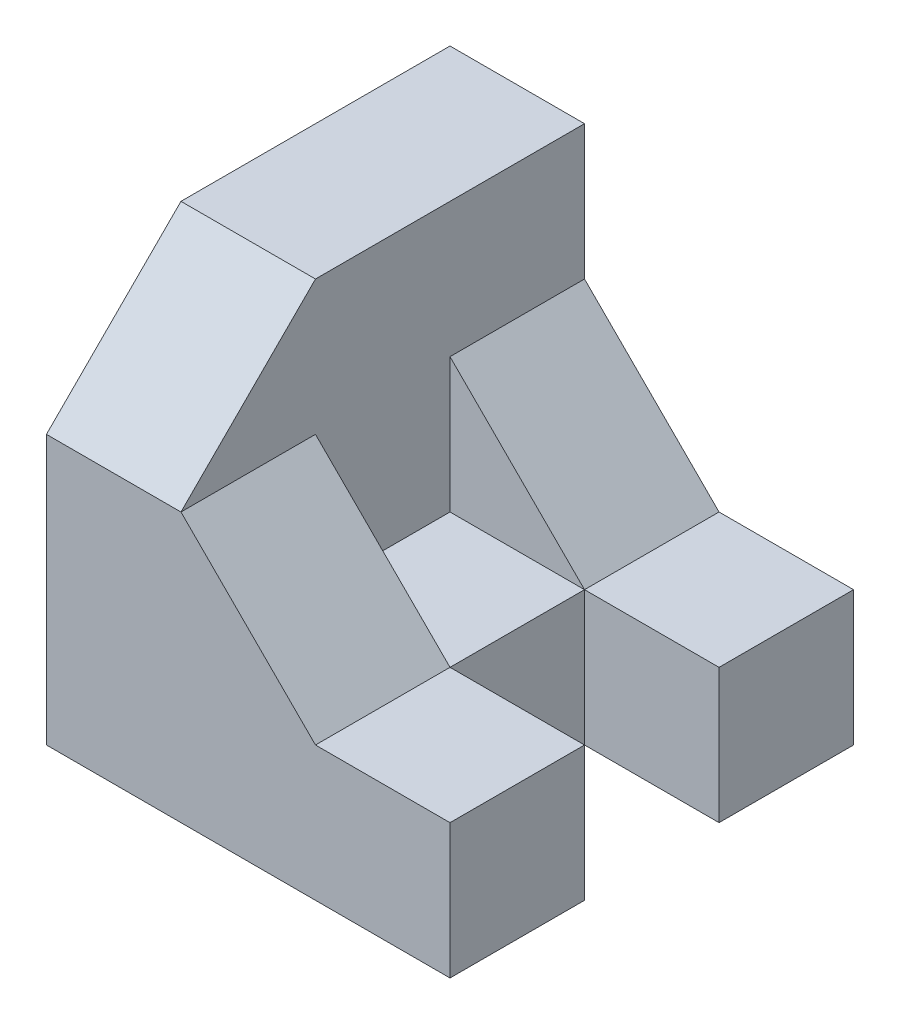
ISO-10303-21;
HEADER;
FILE_DESCRIPTION(('STEP AP214'),'2;1');
FILE_NAME('part.step','',(''),(''),'','','');
FILE_SCHEMA(('AUTOMOTIVE_DESIGN { 1 0 10303 214 1 1 1 1 }'));
ENDSEC;
DATA;
#1=APPLICATION_CONTEXT('core data for automotive mechanical design processes');
#2=APPLICATION_PROTOCOL_DEFINITION('international standard','automotive_design',2000,#1);
#3=PRODUCT_CONTEXT('',#1,'mechanical');
#4=PRODUCT('Part','Part','',(#3));
#5=PRODUCT_RELATED_PRODUCT_CATEGORY('part','',(#4));
#6=PRODUCT_DEFINITION_FORMATION('','',#4);
#7=PRODUCT_DEFINITION_CONTEXT('part definition',#1,'design');
#8=PRODUCT_DEFINITION('design','',#6,#7);
#9=PRODUCT_DEFINITION_SHAPE('','',#8);
#10=(LENGTH_UNIT() NAMED_UNIT(*) SI_UNIT(.MILLI.,.METRE.));
#11=(NAMED_UNIT(*) PLANE_ANGLE_UNIT() SI_UNIT($,.RADIAN.));
#12=(NAMED_UNIT(*) SI_UNIT($,.STERADIAN.) SOLID_ANGLE_UNIT());
#13=UNCERTAINTY_MEASURE_WITH_UNIT(LENGTH_MEASURE(1.E-05),#10,'distance_accuracy_value','');
#14=(GEOMETRIC_REPRESENTATION_CONTEXT(3) GLOBAL_UNCERTAINTY_ASSIGNED_CONTEXT((#13)) GLOBAL_UNIT_ASSIGNED_CONTEXT((#10,
#11,#12)) REPRESENTATION_CONTEXT('',''));
#15=CARTESIAN_POINT('',(0.,0.,0.));
#16=DIRECTION('',(0.,0.,1.));
#17=DIRECTION('',(1.,0.,0.));
#18=AXIS2_PLACEMENT_3D('',#15,#16,#17);
#19=CARTESIAN_POINT('',(60.,60.,0.));
#20=DIRECTION('',(-1.,0.,0.));
#21=DIRECTION('',(0.,0.,1.));
#22=AXIS2_PLACEMENT_3D('',#19,#20,#21);
#23=PLANE('',#22);
#24=DIRECTION('',(0.,0.,-1.));
#25=VECTOR('',#24,1.);
#26=CARTESIAN_POINT('',(60.,20.,0.));
#27=LINE('',#26,#25);
#28=CARTESIAN_POINT('',(60.,20.,20.));
#29=VERTEX_POINT('',#28);
#30=CARTESIAN_POINT('',(60.,20.,0.));
#31=VERTEX_POINT('',#30);
#32=EDGE_CURVE('E174',#29,#31,#27,.T.);
#33=ORIENTED_EDGE('',*,*,#32,.F.);
#34=DIRECTION('',(0.,1.,0.));
#35=VECTOR('',#34,1.);
#36=CARTESIAN_POINT('',(60.,-40.,20.));
#37=LINE('',#36,#35);
#38=CARTESIAN_POINT('',(60.,0.,20.));
#39=VERTEX_POINT('',#38);
#40=EDGE_CURVE('E89',#39,#29,#37,.T.);
#41=ORIENTED_EDGE('',*,*,#40,.F.);
#42=DIRECTION('',(0.,0.,-1.));
#43=VECTOR('',#42,1.);
#44=CARTESIAN_POINT('',(60.,0.,0.));
#45=LINE('',#44,#43);
#46=CARTESIAN_POINT('',(60.,0.,0.));
#47=VERTEX_POINT('',#46);
#48=EDGE_CURVE('E82',#39,#47,#45,.T.);
#49=ORIENTED_EDGE('',*,*,#48,.T.);
#50=DIRECTION('',(0.,-1.,0.));
#51=VECTOR('',#50,1.);
#52=CARTESIAN_POINT('',(60.,60.,0.));
#53=LINE('',#52,#51);
#54=EDGE_CURVE('E86',#31,#47,#53,.T.);
#55=ORIENTED_EDGE('',*,*,#54,.F.);
#56=EDGE_LOOP('',(#33,#41,#49,#55));
#57=FACE_BOUND('',#56,.T.);
#58=ADVANCED_FACE('F39',(#57),#23,.F.);
#59=CARTESIAN_POINT('',(0.,20.,0.));
#60=DIRECTION('',(0.,-1.,0.));
#61=DIRECTION('',(0.,0.,-1.));
#62=AXIS2_PLACEMENT_3D('',#59,#60,#61);
#63=PLANE('',#62);
#64=DIRECTION('',(0.,0.,1.));
#65=VECTOR('',#64,1.);
#66=CARTESIAN_POINT('',(40.,20.,0.));
#67=LINE('',#66,#65);
#68=CARTESIAN_POINT('',(40.,20.,0.));
#69=VERTEX_POINT('',#68);
#70=CARTESIAN_POINT('',(40.,20.,20.));
#71=VERTEX_POINT('',#70);
#72=EDGE_CURVE('E163',#69,#71,#67,.T.);
#73=ORIENTED_EDGE('',*,*,#72,.T.);
#74=DIRECTION('',(-1.,0.,0.));
#75=VECTOR('',#74,1.);
#76=CARTESIAN_POINT('',(60.,20.,20.));
#77=LINE('',#76,#75);
#78=EDGE_CURVE('E251',#29,#71,#77,.T.);
#79=ORIENTED_EDGE('',*,*,#78,.F.);
#80=ORIENTED_EDGE('',*,*,#32,.T.);
#81=DIRECTION('',(-1.,0.,0.));
#82=VECTOR('',#81,1.);
#83=CARTESIAN_POINT('',(60.,20.,0.));
#84=LINE('',#83,#82);
#85=EDGE_CURVE('E104',#31,#69,#84,.T.);
#86=ORIENTED_EDGE('',*,*,#85,.T.);
#87=EDGE_LOOP('',(#73,#79,#80,#86));
#88=FACE_BOUND('',#87,.T.);
#89=ADVANCED_FACE('F289',(#88),#63,.F.);
#90=CARTESIAN_POINT('',(60.,20.,60.));
#91=VERTEX_POINT('',#90);
#92=CARTESIAN_POINT('',(60.,20.,40.));
#93=VERTEX_POINT('',#92);
#94=EDGE_CURVE('E170',#91,#93,#27,.T.);
#95=ORIENTED_EDGE('',*,*,#94,.T.);
#96=DIRECTION('',(1.,0.,0.));
#97=VECTOR('',#96,1.);
#98=CARTESIAN_POINT('',(40.,20.,40.));
#99=LINE('',#98,#97);
#100=CARTESIAN_POINT('',(40.,20.,40.));
#101=VERTEX_POINT('',#100);
#102=EDGE_CURVE('E234',#101,#93,#99,.T.);
#103=ORIENTED_EDGE('',*,*,#102,.F.);
#104=CARTESIAN_POINT('',(40.,20.,60.));
#105=VERTEX_POINT('',#104);
#106=EDGE_CURVE('E167',#101,#105,#67,.T.);
#107=ORIENTED_EDGE('',*,*,#106,.T.);
#108=DIRECTION('',(1.,0.,0.));
#109=VECTOR('',#108,1.);
#110=CARTESIAN_POINT('',(60.,20.,60.));
#111=LINE('',#110,#109);
#112=EDGE_CURVE('E156',#105,#91,#111,.T.);
#113=ORIENTED_EDGE('',*,*,#112,.T.);
#114=EDGE_LOOP('',(#95,#103,#107,#113));
#115=FACE_BOUND('',#114,.T.);
#116=ADVANCED_FACE('F316',(#115),#63,.F.);
#117=CARTESIAN_POINT('',(0.,60.,0.));
#118=DIRECTION('',(1.,0.,0.));
#119=DIRECTION('',(0.,0.,-1.));
#120=AXIS2_PLACEMENT_3D('',#117,#118,#119);
#121=PLANE('',#120);
#122=DIRECTION('',(0.,-1.,0.));
#123=VECTOR('',#122,1.);
#124=CARTESIAN_POINT('',(0.,60.,60.));
#125=LINE('',#124,#123);
#126=CARTESIAN_POINT('',(0.,40.,60.));
#127=VERTEX_POINT('',#126);
#128=CARTESIAN_POINT('',(0.,0.,60.));
#129=VERTEX_POINT('',#128);
#130=EDGE_CURVE('E48',#127,#129,#125,.T.);
#131=ORIENTED_EDGE('',*,*,#130,.F.);
#132=DIRECTION('',(0.,0.707106781186547,-0.707106781186548));
#133=VECTOR('',#132,1.);
#134=CARTESIAN_POINT('',(0.,60.,40.));
#135=LINE('',#134,#133);
#136=CARTESIAN_POINT('',(0.,60.,40.));
#137=VERTEX_POINT('',#136);
#138=EDGE_CURVE('E179',#127,#137,#135,.T.);
#139=ORIENTED_EDGE('',*,*,#138,.T.);
#140=DIRECTION('',(0.,0.,1.));
#141=VECTOR('',#140,1.);
#142=CARTESIAN_POINT('',(0.,60.,0.));
#143=LINE('',#142,#141);
#144=CARTESIAN_POINT('',(0.,60.,0.));
#145=VERTEX_POINT('',#144);
#146=EDGE_CURVE('E115',#145,#137,#143,.T.);
#147=ORIENTED_EDGE('',*,*,#146,.F.);
#148=DIRECTION('',(0.,-1.,0.));
#149=VECTOR('',#148,1.);
#150=CARTESIAN_POINT('',(0.,60.,0.));
#151=LINE('',#150,#149);
#152=CARTESIAN_POINT('',(0.,0.,0.));
#153=VERTEX_POINT('',#152);
#154=EDGE_CURVE('E107',#145,#153,#151,.T.);
#155=ORIENTED_EDGE('',*,*,#154,.T.);
#156=DIRECTION('',(0.,0.,1.));
#157=VECTOR('',#156,1.);
#158=CARTESIAN_POINT('',(0.,0.,0.));
#159=LINE('',#158,#157);
#160=EDGE_CURVE('E113',#153,#129,#159,.T.);
#161=ORIENTED_EDGE('',*,*,#160,.T.);
#162=EDGE_LOOP('',(#131,#139,#147,#155,#161));
#163=FACE_BOUND('',#162,.T.);
#164=ADVANCED_FACE('F41',(#163),#121,.F.);
#165=CARTESIAN_POINT('',(0.,60.,60.));
#166=DIRECTION('',(0.,0.,-1.));
#167=DIRECTION('',(-1.,0.,0.));
#168=AXIS2_PLACEMENT_3D('',#165,#166,#167);
#169=PLANE('',#168);
#170=ORIENTED_EDGE('',*,*,#112,.F.);
#171=DIRECTION('',(0.707106781186547,-0.707106781186548,0.));
#172=VECTOR('',#171,1.);
#173=CARTESIAN_POINT('',(20.,40.,60.));
#174=LINE('',#173,#172);
#175=CARTESIAN_POINT('',(20.,40.,60.));
#176=VERTEX_POINT('',#175);
#177=EDGE_CURVE('E213',#176,#105,#174,.T.);
#178=ORIENTED_EDGE('',*,*,#177,.F.);
#179=DIRECTION('',(1.,0.,0.));
#180=VECTOR('',#179,1.);
#181=CARTESIAN_POINT('',(0.,40.,60.));
#182=LINE('',#181,#180);
#183=EDGE_CURVE('E138',#127,#176,#182,.T.);
#184=ORIENTED_EDGE('',*,*,#183,.F.);
#185=ORIENTED_EDGE('',*,*,#130,.T.);
#186=DIRECTION('',(1.,0.,0.));
#187=VECTOR('',#186,1.);
#188=CARTESIAN_POINT('',(0.,0.,60.));
#189=LINE('',#188,#187);
#190=CARTESIAN_POINT('',(60.,0.,60.));
#191=VERTEX_POINT('',#190);
#192=EDGE_CURVE('E95',#129,#191,#189,.T.);
#193=ORIENTED_EDGE('',*,*,#192,.T.);
#194=DIRECTION('',(0.,-1.,0.));
#195=VECTOR('',#194,1.);
#196=CARTESIAN_POINT('',(60.,60.,60.));
#197=LINE('',#196,#195);
#198=EDGE_CURVE('E106',#91,#191,#197,.T.);
#199=ORIENTED_EDGE('',*,*,#198,.F.);
#200=EDGE_LOOP('',(#170,#178,#184,#185,#193,#199));
#201=FACE_BOUND('',#200,.T.);
#202=ADVANCED_FACE('F132',(#201),#169,.F.);
#203=CARTESIAN_POINT('',(60.,0.,40.));
#204=VERTEX_POINT('',#203);
#205=EDGE_CURVE('E94',#191,#204,#45,.T.);
#206=ORIENTED_EDGE('',*,*,#205,.T.);
#207=DIRECTION('',(0.,1.,0.));
#208=VECTOR('',#207,1.);
#209=CARTESIAN_POINT('',(60.,-40.,40.));
#210=LINE('',#209,#208);
#211=EDGE_CURVE('E238',#204,#93,#210,.T.);
#212=ORIENTED_EDGE('',*,*,#211,.T.);
#213=ORIENTED_EDGE('',*,*,#94,.F.);
#214=ORIENTED_EDGE('',*,*,#198,.T.);
#215=EDGE_LOOP('',(#206,#212,#213,#214));
#216=FACE_BOUND('',#215,.T.);
#217=ADVANCED_FACE('F320',(#216),#23,.F.);
#218=CARTESIAN_POINT('',(0.,60.,0.));
#219=DIRECTION('',(0.,0.,1.));
#220=DIRECTION('',(1.,0.,0.));
#221=AXIS2_PLACEMENT_3D('',#218,#219,#220);
#222=PLANE('',#221);
#223=DIRECTION('',(0.,1.,0.));
#224=VECTOR('',#223,1.);
#225=CARTESIAN_POINT('',(20.,40.,0.));
#226=LINE('',#225,#224);
#227=CARTESIAN_POINT('',(20.,40.,0.));
#228=VERTEX_POINT('',#227);
#229=CARTESIAN_POINT('',(20.,60.,0.));
#230=VERTEX_POINT('',#229);
#231=EDGE_CURVE('E55',#228,#230,#226,.T.);
#232=ORIENTED_EDGE('',*,*,#231,.F.);
#233=DIRECTION('',(0.707106781186547,-0.707106781186548,0.));
#234=VECTOR('',#233,1.);
#235=CARTESIAN_POINT('',(20.,40.,0.));
#236=LINE('',#235,#234);
#237=EDGE_CURVE('E212',#228,#69,#236,.T.);
#238=ORIENTED_EDGE('',*,*,#237,.T.);
#239=ORIENTED_EDGE('',*,*,#85,.F.);
#240=ORIENTED_EDGE('',*,*,#54,.T.);
#241=DIRECTION('',(-1.,0.,0.));
#242=VECTOR('',#241,1.);
#243=CARTESIAN_POINT('',(0.,0.,0.));
#244=LINE('',#243,#242);
#245=EDGE_CURVE('E100',#47,#153,#244,.T.);
#246=ORIENTED_EDGE('',*,*,#245,.T.);
#247=ORIENTED_EDGE('',*,*,#154,.F.);
#248=DIRECTION('',(-1.,0.,0.));
#249=VECTOR('',#248,1.);
#250=CARTESIAN_POINT('',(0.,60.,0.));
#251=LINE('',#250,#249);
#252=EDGE_CURVE('E63',#230,#145,#251,.T.);
#253=ORIENTED_EDGE('',*,*,#252,.F.);
#254=EDGE_LOOP('',(#232,#238,#239,#240,#246,#247,#253));
#255=FACE_BOUND('',#254,.T.);
#256=ADVANCED_FACE('F99',(#255),#222,.F.);
#257=CARTESIAN_POINT('',(0.,60.,0.));
#258=DIRECTION('',(0.,1.,0.));
#259=DIRECTION('',(0.,0.,1.));
#260=AXIS2_PLACEMENT_3D('',#257,#258,#259);
#261=PLANE('',#260);
#262=DIRECTION('',(1.,0.,0.));
#263=VECTOR('',#262,1.);
#264=CARTESIAN_POINT('',(0.,60.,40.));
#265=LINE('',#264,#263);
#266=CARTESIAN_POINT('',(20.,60.,40.));
#267=VERTEX_POINT('',#266);
#268=EDGE_CURVE('E175',#137,#267,#265,.T.);
#269=ORIENTED_EDGE('',*,*,#268,.T.);
#270=DIRECTION('',(0.,0.,1.));
#271=VECTOR('',#270,1.);
#272=CARTESIAN_POINT('',(20.,60.,0.));
#273=LINE('',#272,#271);
#274=EDGE_CURVE('E152',#230,#267,#273,.T.);
#275=ORIENTED_EDGE('',*,*,#274,.F.);
#276=ORIENTED_EDGE('',*,*,#252,.T.);
#277=ORIENTED_EDGE('',*,*,#146,.T.);
#278=EDGE_LOOP('',(#269,#275,#276,#277));
#279=FACE_BOUND('',#278,.T.);
#280=ADVANCED_FACE('F345',(#279),#261,.T.);
#281=CARTESIAN_POINT('',(0.,0.,0.));
#282=DIRECTION('',(0.,1.,0.));
#283=DIRECTION('',(0.,0.,1.));
#284=AXIS2_PLACEMENT_3D('',#281,#282,#283);
#285=PLANE('',#284);
#286=ORIENTED_EDGE('',*,*,#48,.F.);
#287=DIRECTION('',(-1.,0.,0.));
#288=VECTOR('',#287,1.);
#289=CARTESIAN_POINT('',(0.,0.,20.));
#290=LINE('',#289,#288);
#291=CARTESIAN_POINT('',(40.,0.,20.));
#292=VERTEX_POINT('',#291);
#293=EDGE_CURVE('E217',#39,#292,#290,.T.);
#294=ORIENTED_EDGE('',*,*,#293,.T.);
#295=DIRECTION('',(0.,0.,1.));
#296=VECTOR('',#295,1.);
#297=CARTESIAN_POINT('',(40.,0.,0.));
#298=LINE('',#297,#296);
#299=CARTESIAN_POINT('',(40.,0.,40.));
#300=VERTEX_POINT('',#299);
#301=EDGE_CURVE('E225',#292,#300,#298,.T.);
#302=ORIENTED_EDGE('',*,*,#301,.T.);
#303=DIRECTION('',(1.,0.,0.));
#304=VECTOR('',#303,1.);
#305=CARTESIAN_POINT('',(0.,0.,40.));
#306=LINE('',#305,#304);
#307=EDGE_CURVE('E222',#300,#204,#306,.T.);
#308=ORIENTED_EDGE('',*,*,#307,.T.);
#309=ORIENTED_EDGE('',*,*,#205,.F.);
#310=ORIENTED_EDGE('',*,*,#192,.F.);
#311=ORIENTED_EDGE('',*,*,#160,.F.);
#312=ORIENTED_EDGE('',*,*,#245,.F.);
#313=EDGE_LOOP('',(#286,#294,#302,#308,#309,#310,#311,#312));
#314=FACE_BOUND('',#313,.T.);
#315=ADVANCED_FACE('F110',(#314),#285,.F.);
#316=CARTESIAN_POINT('',(20.,40.,0.));
#317=DIRECTION('',(-1.,0.,0.));
#318=DIRECTION('',(0.,0.,1.));
#319=AXIS2_PLACEMENT_3D('',#316,#317,#318);
#320=PLANE('',#319);
#321=DIRECTION('',(0.,1.,0.));
#322=VECTOR('',#321,1.);
#323=CARTESIAN_POINT('',(20.0000000000002,20.,20.));
#324=LINE('',#323,#322);
#325=CARTESIAN_POINT('',(20.0000000000002,20.,20.));
#326=VERTEX_POINT('',#325);
#327=CARTESIAN_POINT('',(20.0000000000002,40.,20.));
#328=VERTEX_POINT('',#327);
#329=EDGE_CURVE('E192',#326,#328,#324,.T.);
#330=ORIENTED_EDGE('',*,*,#329,.T.);
#331=DIRECTION('',(0.,0.,1.));
#332=VECTOR('',#331,1.);
#333=CARTESIAN_POINT('',(20.,40.,0.));
#334=LINE('',#333,#332);
#335=EDGE_CURVE('E147',#228,#328,#334,.T.);
#336=ORIENTED_EDGE('',*,*,#335,.F.);
#337=ORIENTED_EDGE('',*,*,#231,.T.);
#338=ORIENTED_EDGE('',*,*,#274,.T.);
#339=DIRECTION('',(0.,0.707106781186547,-0.707106781186548));
#340=VECTOR('',#339,1.);
#341=CARTESIAN_POINT('',(20.,60.,40.));
#342=LINE('',#341,#340);
#343=EDGE_CURVE('E182',#176,#267,#342,.T.);
#344=ORIENTED_EDGE('',*,*,#343,.F.);
#345=CARTESIAN_POINT('',(20.,40.,40.));
#346=VERTEX_POINT('',#345);
#347=EDGE_CURVE('E155',#346,#176,#334,.T.);
#348=ORIENTED_EDGE('',*,*,#347,.F.);
#349=DIRECTION('',(0.,1.,0.));
#350=VECTOR('',#349,1.);
#351=CARTESIAN_POINT('',(20.0000000000002,20.,40.));
#352=LINE('',#351,#350);
#353=CARTESIAN_POINT('',(20.0000000000002,20.,40.));
#354=VERTEX_POINT('',#353);
#355=EDGE_CURVE('E186',#354,#346,#352,.T.);
#356=ORIENTED_EDGE('',*,*,#355,.F.);
#357=DIRECTION('',(0.,0.,1.));
#358=VECTOR('',#357,1.);
#359=CARTESIAN_POINT('',(20.0000000000002,20.,20.));
#360=LINE('',#359,#358);
#361=EDGE_CURVE('E196',#326,#354,#360,.T.);
#362=ORIENTED_EDGE('',*,*,#361,.F.);
#363=EDGE_LOOP('',(#330,#336,#337,#338,#344,#348,#356,#362));
#364=FACE_BOUND('',#363,.T.);
#365=ADVANCED_FACE('F340',(#364),#320,.F.);
#366=DIRECTION('',(1.,0.,0.));
#367=VECTOR('',#366,1.);
#368=CARTESIAN_POINT('',(20.0000000000002,20.,40.));
#369=LINE('',#368,#367);
#370=EDGE_CURVE('E200',#354,#101,#369,.T.);
#371=ORIENTED_EDGE('',*,*,#370,.T.);
#372=DIRECTION('',(0.,0.,1.));
#373=VECTOR('',#372,1.);
#374=CARTESIAN_POINT('',(40.,20.,20.));
#375=LINE('',#374,#373);
#376=EDGE_CURVE('E247',#71,#101,#375,.T.);
#377=ORIENTED_EDGE('',*,*,#376,.F.);
#378=DIRECTION('',(1.,0.,0.));
#379=VECTOR('',#378,1.);
#380=CARTESIAN_POINT('',(20.0000000000002,20.,20.));
#381=LINE('',#380,#379);
#382=EDGE_CURVE('E204',#326,#71,#381,.T.);
#383=ORIENTED_EDGE('',*,*,#382,.F.);
#384=ORIENTED_EDGE('',*,*,#361,.T.);
#385=EDGE_LOOP('',(#371,#377,#383,#384));
#386=FACE_BOUND('',#385,.T.);
#387=ADVANCED_FACE('F276',(#386),#63,.F.);
#388=CARTESIAN_POINT('',(0.,60.,40.));
#389=DIRECTION('',(0.,-0.707106781186548,-0.707106781186547));
#390=DIRECTION('',(0.,0.707106781186547,-0.707106781186548));
#391=AXIS2_PLACEMENT_3D('',#388,#389,#390);
#392=PLANE('',#391);
#393=ORIENTED_EDGE('',*,*,#343,.T.);
#394=ORIENTED_EDGE('',*,*,#268,.F.);
#395=ORIENTED_EDGE('',*,*,#138,.F.);
#396=ORIENTED_EDGE('',*,*,#183,.T.);
#397=EDGE_LOOP('',(#393,#394,#395,#396));
#398=FACE_BOUND('',#397,.T.);
#399=ADVANCED_FACE('F344',(#398),#392,.F.);
#400=CARTESIAN_POINT('',(20.0000000000002,20.,20.));
#401=DIRECTION('',(0.,0.,1.));
#402=DIRECTION('',(1.,0.,0.));
#403=AXIS2_PLACEMENT_3D('',#400,#401,#402);
#404=PLANE('',#403);
#405=DIRECTION('',(0.707106781186547,-0.707106781186548,0.));
#406=VECTOR('',#405,1.);
#407=CARTESIAN_POINT('',(30.0000000000001,29.9999999999999,20.));
#408=LINE('',#407,#406);
#409=EDGE_CURVE('E208',#328,#71,#408,.T.);
#410=ORIENTED_EDGE('',*,*,#409,.F.);
#411=ORIENTED_EDGE('',*,*,#329,.F.);
#412=ORIENTED_EDGE('',*,*,#382,.T.);
#413=EDGE_LOOP('',(#410,#411,#412));
#414=FACE_BOUND('',#413,.T.);
#415=ADVANCED_FACE('F288',(#414),#404,.T.);
#416=CARTESIAN_POINT('',(20.0000000000002,20.,40.));
#417=DIRECTION('',(0.,0.,1.));
#418=DIRECTION('',(1.,0.,0.));
#419=AXIS2_PLACEMENT_3D('',#416,#417,#418);
#420=PLANE('',#419);
#421=ORIENTED_EDGE('',*,*,#355,.T.);
#422=DIRECTION('',(0.707106781186547,-0.707106781186548,0.));
#423=VECTOR('',#422,1.);
#424=CARTESIAN_POINT('',(30.0000000000001,29.9999999999999,40.));
#425=LINE('',#424,#423);
#426=EDGE_CURVE('E11',#346,#101,#425,.T.);
#427=ORIENTED_EDGE('',*,*,#426,.T.);
#428=ORIENTED_EDGE('',*,*,#370,.F.);
#429=EDGE_LOOP('',(#421,#427,#428));
#430=FACE_BOUND('',#429,.T.);
#431=ADVANCED_FACE('F337',(#430),#420,.F.);
#432=CARTESIAN_POINT('',(20.,40.,0.));
#433=DIRECTION('',(-0.707106781186548,-0.707106781186547,0.));
#434=DIRECTION('',(0.707106781186547,-0.707106781186548,0.));
#435=AXIS2_PLACEMENT_3D('',#432,#433,#434);
#436=PLANE('',#435);
#437=ORIENTED_EDGE('',*,*,#347,.T.);
#438=ORIENTED_EDGE('',*,*,#177,.T.);
#439=ORIENTED_EDGE('',*,*,#106,.F.);
#440=ORIENTED_EDGE('',*,*,#426,.F.);
#441=EDGE_LOOP('',(#437,#438,#439,#440));
#442=FACE_BOUND('',#441,.T.);
#443=ADVANCED_FACE('F334',(#442),#436,.F.);
#444=ORIENTED_EDGE('',*,*,#409,.T.);
#445=ORIENTED_EDGE('',*,*,#72,.F.);
#446=ORIENTED_EDGE('',*,*,#237,.F.);
#447=ORIENTED_EDGE('',*,*,#335,.T.);
#448=EDGE_LOOP('',(#444,#445,#446,#447));
#449=FACE_BOUND('',#448,.T.);
#450=ADVANCED_FACE('F283',(#449),#436,.F.);
#451=CARTESIAN_POINT('',(60.,-40.,20.));
#452=DIRECTION('',(0.,0.,-1.));
#453=DIRECTION('',(-1.,0.,0.));
#454=AXIS2_PLACEMENT_3D('',#451,#452,#453);
#455=PLANE('',#454);
#456=ORIENTED_EDGE('',*,*,#40,.T.);
#457=ORIENTED_EDGE('',*,*,#78,.T.);
#458=DIRECTION('',(0.,1.,0.));
#459=VECTOR('',#458,1.);
#460=CARTESIAN_POINT('',(40.,-40.,20.));
#461=LINE('',#460,#459);
#462=EDGE_CURVE('E229',#292,#71,#461,.T.);
#463=ORIENTED_EDGE('',*,*,#462,.F.);
#464=ORIENTED_EDGE('',*,*,#293,.F.);
#465=EDGE_LOOP('',(#456,#457,#463,#464));
#466=FACE_BOUND('',#465,.T.);
#467=ADVANCED_FACE('F258',(#466),#455,.F.);
#468=CARTESIAN_POINT('',(40.,-40.,40.));
#469=DIRECTION('',(0.,0.,1.));
#470=DIRECTION('',(1.,0.,0.));
#471=AXIS2_PLACEMENT_3D('',#468,#469,#470);
#472=PLANE('',#471);
#473=DIRECTION('',(0.,1.,0.));
#474=VECTOR('',#473,1.);
#475=CARTESIAN_POINT('',(40.,-40.,40.));
#476=LINE('',#475,#474);
#477=EDGE_CURVE('E233',#300,#101,#476,.T.);
#478=ORIENTED_EDGE('',*,*,#477,.T.);
#479=ORIENTED_EDGE('',*,*,#102,.T.);
#480=ORIENTED_EDGE('',*,*,#211,.F.);
#481=ORIENTED_EDGE('',*,*,#307,.F.);
#482=EDGE_LOOP('',(#478,#479,#480,#481));
#483=FACE_BOUND('',#482,.T.);
#484=ADVANCED_FACE('F326',(#483),#472,.F.);
#485=CARTESIAN_POINT('',(40.,-40.,20.));
#486=DIRECTION('',(-1.,0.,0.));
#487=DIRECTION('',(0.,0.,1.));
#488=AXIS2_PLACEMENT_3D('',#485,#486,#487);
#489=PLANE('',#488);
#490=ORIENTED_EDGE('',*,*,#462,.T.);
#491=ORIENTED_EDGE('',*,*,#376,.T.);
#492=ORIENTED_EDGE('',*,*,#477,.F.);
#493=ORIENTED_EDGE('',*,*,#301,.F.);
#494=EDGE_LOOP('',(#490,#491,#492,#493));
#495=FACE_BOUND('',#494,.T.);
#496=ADVANCED_FACE('F270',(#495),#489,.F.);
#497=CLOSED_SHELL('',(#58,#89,#116,#164,#202,#217,#256,#280,#315,#365,#387,#399,#415,#431,#443,
#450,#467,#484,#496));
#498=MANIFOLD_SOLID_BREP('B2',#497);
#499=ADVANCED_BREP_SHAPE_REPRESENTATION('',(#18,#498),#14);
#500=SHAPE_DEFINITION_REPRESENTATION(#9,#499);
ENDSEC;
END-ISO-10303-21;
